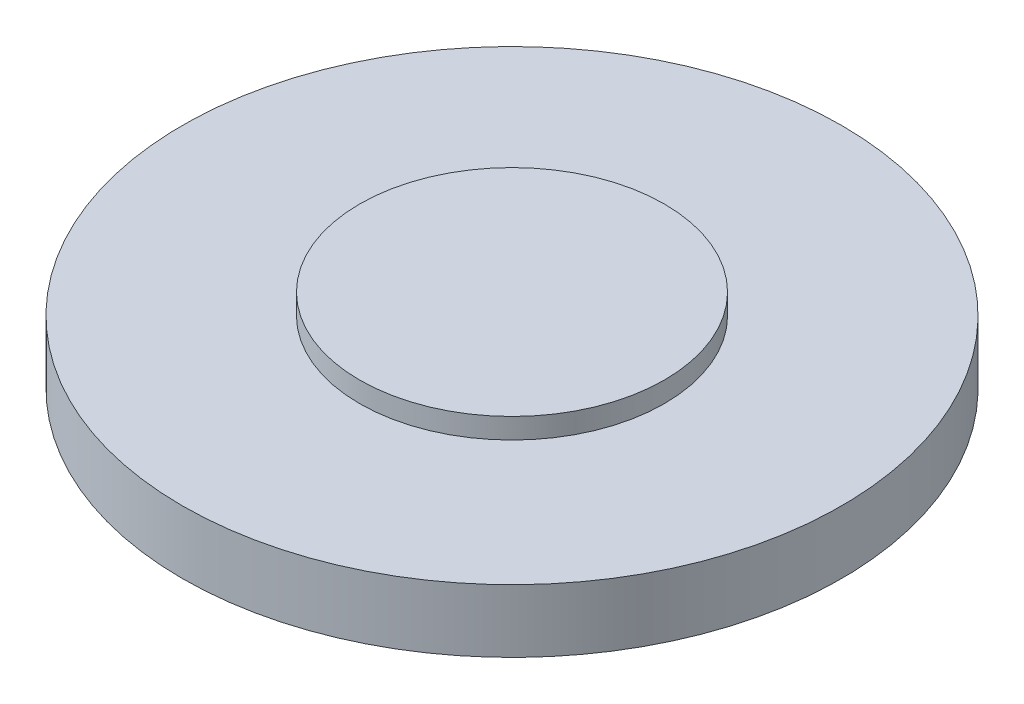
ISO-10303-21;
HEADER;
FILE_DESCRIPTION(('STEP AP214'),'2;1');
FILE_NAME('part.step','',(''),(''),'','','');
FILE_SCHEMA(('AUTOMOTIVE_DESIGN { 1 0 10303 214 1 1 1 1 }'));
ENDSEC;
DATA;
#1=APPLICATION_CONTEXT('core data for automotive mechanical design processes');
#2=APPLICATION_PROTOCOL_DEFINITION('international standard','automotive_design',2000,#1);
#3=PRODUCT_CONTEXT('',#1,'mechanical');
#4=PRODUCT('Part','Part','',(#3));
#5=PRODUCT_RELATED_PRODUCT_CATEGORY('part','',(#4));
#6=PRODUCT_DEFINITION_FORMATION('','',#4);
#7=PRODUCT_DEFINITION_CONTEXT('part definition',#1,'design');
#8=PRODUCT_DEFINITION('design','',#6,#7);
#9=PRODUCT_DEFINITION_SHAPE('','',#8);
#10=(LENGTH_UNIT() NAMED_UNIT(*) SI_UNIT(.MILLI.,.METRE.));
#11=(NAMED_UNIT(*) PLANE_ANGLE_UNIT() SI_UNIT($,.RADIAN.));
#12=(NAMED_UNIT(*) SI_UNIT($,.STERADIAN.) SOLID_ANGLE_UNIT());
#13=UNCERTAINTY_MEASURE_WITH_UNIT(LENGTH_MEASURE(1.E-05),#10,'distance_accuracy_value','');
#14=(GEOMETRIC_REPRESENTATION_CONTEXT(3) GLOBAL_UNCERTAINTY_ASSIGNED_CONTEXT((#13)) GLOBAL_UNIT_ASSIGNED_CONTEXT((#10,
#11,#12)) REPRESENTATION_CONTEXT('',''));
#15=CARTESIAN_POINT('',(0.,0.,0.));
#16=DIRECTION('',(0.,0.,1.));
#17=DIRECTION('',(1.,0.,0.));
#18=AXIS2_PLACEMENT_3D('',#15,#16,#17);
#19=CARTESIAN_POINT('',(0.,3.7,0.));
#20=DIRECTION('',(0.,-1.,0.));
#21=DIRECTION('',(0.,0.,-1.));
#22=AXIS2_PLACEMENT_3D('',#19,#20,#21);
#23=CYLINDRICAL_SURFACE('',#22,19.35);
#24=CARTESIAN_POINT('',(0.,3.7,0.));
#25=DIRECTION('',(0.,1.,0.));
#26=DIRECTION('',(0.,0.,1.));
#27=AXIS2_PLACEMENT_3D('',#24,#25,#26);
#28=CIRCLE('',#27,19.35);
#29=CARTESIAN_POINT('',(0.,3.7,19.35));
#30=VERTEX_POINT('',#29);
#31=EDGE_CURVE('E45',#30,#30,#28,.T.);
#32=ORIENTED_EDGE('',*,*,#31,.F.);
#33=EDGE_LOOP('',(#32));
#34=FACE_BOUND('',#33,.T.);
#35=CARTESIAN_POINT('',(0.,0.,0.));
#36=DIRECTION('',(0.,1.,0.));
#37=DIRECTION('',(0.,0.,1.));
#38=AXIS2_PLACEMENT_3D('',#35,#36,#37);
#39=CIRCLE('',#38,19.35);
#40=CARTESIAN_POINT('',(0.,0.,19.35));
#41=VERTEX_POINT('',#40);
#42=EDGE_CURVE('E41',#41,#41,#39,.T.);
#43=ORIENTED_EDGE('',*,*,#42,.T.);
#44=EDGE_LOOP('',(#43));
#45=FACE_BOUND('',#44,.T.);
#46=ADVANCED_FACE('F38',(#34,#45),#23,.T.);
#47=CARTESIAN_POINT('',(0.,3.7,0.));
#48=DIRECTION('',(0.,1.,0.));
#49=DIRECTION('',(0.,0.,1.));
#50=AXIS2_PLACEMENT_3D('',#47,#48,#49);
#51=PLANE('',#50);
#52=CARTESIAN_POINT('',(0.,3.7,0.));
#53=DIRECTION('',(0.,1.,0.));
#54=DIRECTION('',(0.,0.,1.));
#55=AXIS2_PLACEMENT_3D('',#52,#53,#54);
#56=CIRCLE('',#55,8.95);
#57=CARTESIAN_POINT('',(0.,3.7,8.95));
#58=VERTEX_POINT('',#57);
#59=EDGE_CURVE('E10',#58,#58,#56,.T.);
#60=ORIENTED_EDGE('',*,*,#59,.F.);
#61=EDGE_LOOP('',(#60));
#62=FACE_BOUND('',#61,.T.);
#63=ORIENTED_EDGE('',*,*,#31,.T.);
#64=EDGE_LOOP('',(#63));
#65=FACE_BOUND('',#64,.T.);
#66=ADVANCED_FACE('F74',(#62,#65),#51,.T.);
#67=CARTESIAN_POINT('',(0.,0.,0.));
#68=DIRECTION('',(0.,1.,0.));
#69=DIRECTION('',(0.,0.,1.));
#70=AXIS2_PLACEMENT_3D('',#67,#68,#69);
#71=PLANE('',#70);
#72=CARTESIAN_POINT('',(0.,0.,0.));
#73=DIRECTION('',(0.,-1.,0.));
#74=DIRECTION('',(0.,0.,-1.));
#75=AXIS2_PLACEMENT_3D('',#72,#73,#74);
#76=CIRCLE('',#75,18.55);
#77=CARTESIAN_POINT('',(0.,0.,-18.55));
#78=VERTEX_POINT('',#77);
#79=EDGE_CURVE('E55',#78,#78,#76,.T.);
#80=ORIENTED_EDGE('',*,*,#79,.F.);
#81=EDGE_LOOP('',(#80));
#82=FACE_BOUND('',#81,.T.);
#83=ORIENTED_EDGE('',*,*,#42,.F.);
#84=EDGE_LOOP('',(#83));
#85=FACE_BOUND('',#84,.T.);
#86=ADVANCED_FACE('F70',(#82,#85),#71,.F.);
#87=CARTESIAN_POINT('',(0.,4.9,0.));
#88=DIRECTION('',(0.,-1.,0.));
#89=DIRECTION('',(0.,0.,-1.));
#90=AXIS2_PLACEMENT_3D('',#87,#88,#89);
#91=CYLINDRICAL_SURFACE('',#90,8.95);
#92=CARTESIAN_POINT('',(0.,4.9,0.));
#93=DIRECTION('',(0.,1.,0.));
#94=DIRECTION('',(0.,0.,1.));
#95=AXIS2_PLACEMENT_3D('',#92,#93,#94);
#96=CIRCLE('',#95,8.95);
#97=CARTESIAN_POINT('',(0.,4.9,8.95));
#98=VERTEX_POINT('',#97);
#99=EDGE_CURVE('E51',#98,#98,#96,.T.);
#100=ORIENTED_EDGE('',*,*,#99,.F.);
#101=EDGE_LOOP('',(#100));
#102=FACE_BOUND('',#101,.T.);
#103=ORIENTED_EDGE('',*,*,#59,.T.);
#104=EDGE_LOOP('',(#103));
#105=FACE_BOUND('',#104,.T.);
#106=ADVANCED_FACE('F73',(#102,#105),#91,.T.);
#107=CARTESIAN_POINT('',(0.,4.9,0.));
#108=DIRECTION('',(0.,1.,0.));
#109=DIRECTION('',(0.,0.,1.));
#110=AXIS2_PLACEMENT_3D('',#107,#108,#109);
#111=PLANE('',#110);
#112=ORIENTED_EDGE('',*,*,#99,.T.);
#113=EDGE_LOOP('',(#112));
#114=FACE_BOUND('',#113,.T.);
#115=ADVANCED_FACE('F66',(#114),#111,.T.);
#116=CARTESIAN_POINT('',(0.,1.5,0.));
#117=DIRECTION('',(0.,-1.,0.));
#118=DIRECTION('',(0.,0.,-1.));
#119=AXIS2_PLACEMENT_3D('',#116,#117,#118);
#120=CYLINDRICAL_SURFACE('',#119,18.55);
#121=CARTESIAN_POINT('',(0.,1.5,0.));
#122=DIRECTION('',(0.,-1.,0.));
#123=DIRECTION('',(0.,0.,-1.));
#124=AXIS2_PLACEMENT_3D('',#121,#122,#123);
#125=CIRCLE('',#124,18.55);
#126=CARTESIAN_POINT('',(0.,1.5,-18.55));
#127=VERTEX_POINT('',#126);
#128=EDGE_CURVE('E54',#127,#127,#125,.T.);
#129=ORIENTED_EDGE('',*,*,#128,.F.);
#130=EDGE_LOOP('',(#129));
#131=FACE_BOUND('',#130,.T.);
#132=ORIENTED_EDGE('',*,*,#79,.T.);
#133=EDGE_LOOP('',(#132));
#134=FACE_BOUND('',#133,.T.);
#135=ADVANCED_FACE('F63',(#131,#134),#120,.F.);
#136=CARTESIAN_POINT('',(0.,1.5,0.));
#137=DIRECTION('',(0.,-1.,0.));
#138=DIRECTION('',(0.,0.,-1.));
#139=AXIS2_PLACEMENT_3D('',#136,#137,#138);
#140=PLANE('',#139);
#141=ORIENTED_EDGE('',*,*,#128,.T.);
#142=EDGE_LOOP('',(#141));
#143=FACE_BOUND('',#142,.T.);
#144=ADVANCED_FACE('F61',(#143),#140,.T.);
#145=CLOSED_SHELL('',(#46,#66,#86,#106,#115,#135,#144));
#146=MANIFOLD_SOLID_BREP('B2',#145);
#147=ADVANCED_BREP_SHAPE_REPRESENTATION('',(#18,#146),#14);
#148=SHAPE_DEFINITION_REPRESENTATION(#9,#147);
ENDSEC;
END-ISO-10303-21;
